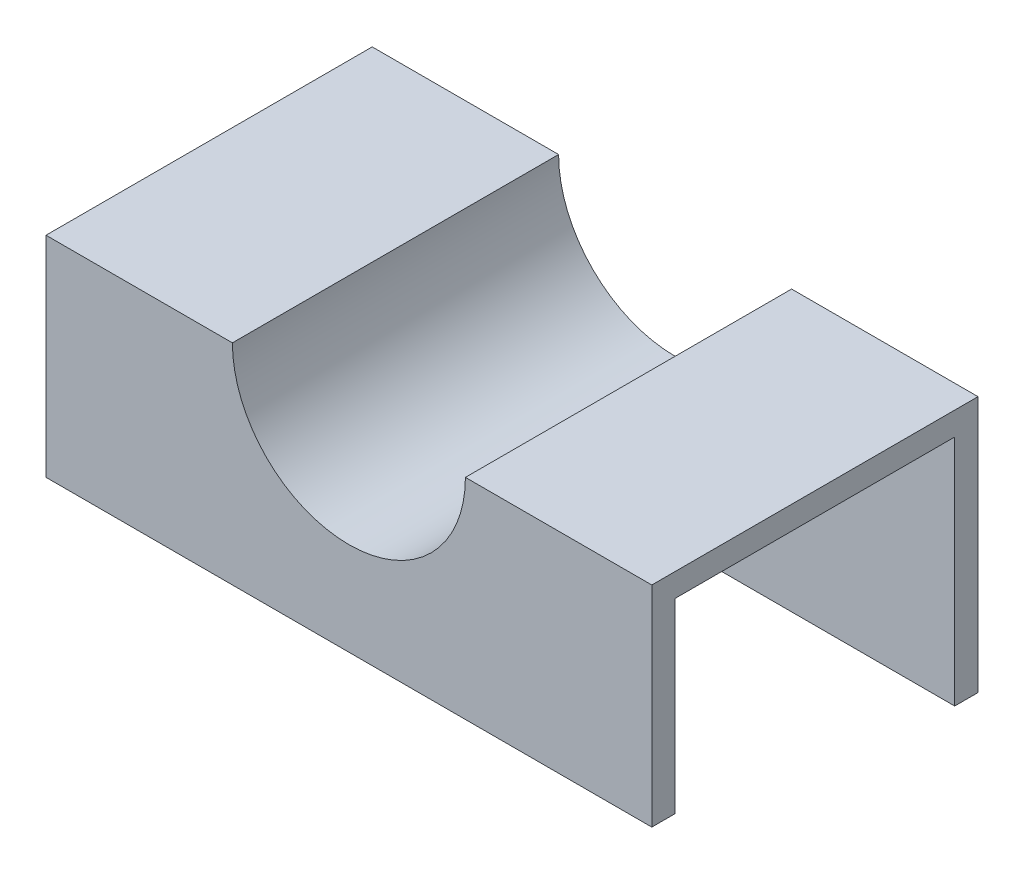
ISO-10303-21;
HEADER;
FILE_DESCRIPTION(('STEP AP214'),'2;1');
FILE_NAME('part.step','',(''),(''),'','','');
FILE_SCHEMA(('AUTOMOTIVE_DESIGN { 1 0 10303 214 1 1 1 1 }'));
ENDSEC;
DATA;
#1=APPLICATION_CONTEXT('core data for automotive mechanical design processes');
#2=APPLICATION_PROTOCOL_DEFINITION('international standard','automotive_design',2000,#1);
#3=PRODUCT_CONTEXT('',#1,'mechanical');
#4=PRODUCT('Part','Part','',(#3));
#5=PRODUCT_RELATED_PRODUCT_CATEGORY('part','',(#4));
#6=PRODUCT_DEFINITION_FORMATION('','',#4);
#7=PRODUCT_DEFINITION_CONTEXT('part definition',#1,'design');
#8=PRODUCT_DEFINITION('design','',#6,#7);
#9=PRODUCT_DEFINITION_SHAPE('','',#8);
#10=(LENGTH_UNIT() NAMED_UNIT(*) SI_UNIT(.MILLI.,.METRE.));
#11=(NAMED_UNIT(*) PLANE_ANGLE_UNIT() SI_UNIT($,.RADIAN.));
#12=(NAMED_UNIT(*) SI_UNIT($,.STERADIAN.) SOLID_ANGLE_UNIT());
#13=UNCERTAINTY_MEASURE_WITH_UNIT(LENGTH_MEASURE(1.E-05),#10,'distance_accuracy_value','');
#14=(GEOMETRIC_REPRESENTATION_CONTEXT(3) GLOBAL_UNCERTAINTY_ASSIGNED_CONTEXT((#13)) GLOBAL_UNIT_ASSIGNED_CONTEXT((#10,
#11,#12)) REPRESENTATION_CONTEXT('',''));
#15=CARTESIAN_POINT('',(0.,0.,0.));
#16=DIRECTION('',(0.,0.,1.));
#17=DIRECTION('',(1.,0.,0.));
#18=AXIS2_PLACEMENT_3D('',#15,#16,#17);
#19=CARTESIAN_POINT('',(-0.00534350019995957,0.207558409944158,0.00476642100056624));
#20=DIRECTION('',(1.62409768173737E-13,0.,-1.));
#21=DIRECTION('',(-1.,0.,-1.62409768173737E-13));
#22=AXIS2_PLACEMENT_3D('',#19,#20,#21);
#23=CYLINDRICAL_SURFACE('',#22,0.150000000000034);
#24=CARTESIAN_POINT('',(-0.00534350020001235,0.207558409944158,0.32976642100053));
#25=DIRECTION('',(-1.62409768173737E-13,0.,1.));
#26=DIRECTION('',(-1.,0.,-1.62409768173737E-13));
#27=AXIS2_PLACEMENT_3D('',#24,#25,#26);
#28=CIRCLE('',#27,0.150000000000034);
#29=CARTESIAN_POINT('',(-0.153245494777496,0.182558409944152,0.329766421000548));
#30=VERTEX_POINT('',#29);
#31=CARTESIAN_POINT('',(0.142558494377545,0.182558409944195,0.329766421000548));
#32=VERTEX_POINT('',#31);
#33=EDGE_CURVE('E11',#30,#32,#28,.T.);
#34=ORIENTED_EDGE('',*,*,#33,.F.);
#35=DIRECTION('',(0.,0.,1.));
#36=VECTOR('',#35,1.);
#37=CARTESIAN_POINT('',(-0.153245494777457,0.182558409944165,0.329766421000566));
#38=LINE('',#37,#36);
#39=CARTESIAN_POINT('',(-0.153245494777473,0.182558409944165,0.0297664210005843));
#40=VERTEX_POINT('',#39);
#41=EDGE_CURVE('E24',#40,#30,#38,.T.);
#42=ORIENTED_EDGE('',*,*,#41,.F.);
#43=CARTESIAN_POINT('',(-0.00534350019996363,0.207558409944158,0.0297664210006023));
#44=DIRECTION('',(1.62409768173737E-13,0.,-1.));
#45=DIRECTION('',(-1.,0.,-1.62409768173737E-13));
#46=AXIS2_PLACEMENT_3D('',#43,#44,#45);
#47=CIRCLE('',#46,0.150000000000034);
#48=CARTESIAN_POINT('',(0.142558494377571,0.1825584099442,0.0297664210005963));
#49=VERTEX_POINT('',#48);
#50=EDGE_CURVE('E203',#49,#40,#47,.T.);
#51=ORIENTED_EDGE('',*,*,#50,.F.);
#52=DIRECTION('',(0.,0.,-1.));
#53=VECTOR('',#52,1.);
#54=CARTESIAN_POINT('',(0.142558494377571,0.182558409944195,0.329766421000566));
#55=LINE('',#54,#53);
#56=EDGE_CURVE('E200',#32,#49,#55,.T.);
#57=ORIENTED_EDGE('',*,*,#56,.F.);
#58=EDGE_LOOP('',(#34,#42,#51,#57));
#59=FACE_BOUND('',#58,.T.);
#60=ADVANCED_FACE('F17',(#59),#23,.T.);
#61=CARTESIAN_POINT('',(0.319656499800088,0.182558409944213,0.329766421000566));
#62=DIRECTION('',(1.01196828694583E-13,-1.,0.));
#63=DIRECTION('',(1.,1.01196828694583E-13,0.));
#64=AXIS2_PLACEMENT_3D('',#61,#62,#63);
#65=PLANE('',#64);
#66=ORIENTED_EDGE('',*,*,#41,.T.);
#67=DIRECTION('',(1.,0.,0.));
#68=VECTOR('',#67,1.);
#69=CARTESIAN_POINT('',(0.319656499800114,0.182558409944147,0.329766421000566));
#70=LINE('',#69,#68);
#71=CARTESIAN_POINT('',(-0.330343500199882,0.182558409944147,0.329766421000566));
#72=VERTEX_POINT('',#71);
#73=EDGE_CURVE('E198',#72,#30,#70,.T.);
#74=ORIENTED_EDGE('',*,*,#73,.F.);
#75=DIRECTION('',(0.,0.,1.));
#76=VECTOR('',#75,1.);
#77=CARTESIAN_POINT('',(-0.330343500199889,0.182558409944147,0.329766421000566));
#78=LINE('',#77,#76);
#79=CARTESIAN_POINT('',(-0.330343500199889,0.182558409944154,0.0297664210005663));
#80=VERTEX_POINT('',#79);
#81=EDGE_CURVE('E195',#80,#72,#78,.T.);
#82=ORIENTED_EDGE('',*,*,#81,.F.);
#83=DIRECTION('',(-1.,0.,0.));
#84=VECTOR('',#83,1.);
#85=CARTESIAN_POINT('',(-0.00534350019988747,0.182558409944165,0.0297664210005663));
#86=LINE('',#85,#84);
#87=EDGE_CURVE('E192',#40,#80,#86,.T.);
#88=ORIENTED_EDGE('',*,*,#87,.F.);
#89=EDGE_LOOP('',(#66,#74,#82,#88));
#90=FACE_BOUND('',#89,.T.);
#91=ADVANCED_FACE('F207',(#90),#65,.T.);
#92=CARTESIAN_POINT('',(-0.0053435001999368,-0.0174415900558082,0.342266421000566));
#93=DIRECTION('',(1.0119682869504E-13,-1.,0.));
#94=DIRECTION('',(1.,1.0119682869504E-13,0.));
#95=AXIS2_PLACEMENT_3D('',#92,#93,#94);
#96=PLANE('',#95);
#97=DIRECTION('',(-1.,0.,0.));
#98=VECTOR('',#97,1.);
#99=CARTESIAN_POINT('',(0.319656499800114,-0.0174415900557754,0.329766421000566));
#100=LINE('',#99,#98);
#101=CARTESIAN_POINT('',(0.319656499800109,-0.0174415900557754,0.329766421000566));
#102=VERTEX_POINT('',#101);
#103=CARTESIAN_POINT('',(-0.330343500199869,-0.0174415900558192,0.329766421000566));
#104=VERTEX_POINT('',#103);
#105=EDGE_CURVE('E190',#102,#104,#100,.T.);
#106=ORIENTED_EDGE('',*,*,#105,.F.);
#107=DIRECTION('',(0.,0.,-1.));
#108=VECTOR('',#107,1.);
#109=CARTESIAN_POINT('',(0.319656499800109,-0.0174415900557754,0.354766421000566));
#110=LINE('',#109,#108);
#111=CARTESIAN_POINT('',(0.319656499800109,-0.0174415900557973,0.354766421000566));
#112=VERTEX_POINT('',#111);
#113=EDGE_CURVE('E187',#112,#102,#110,.T.);
#114=ORIENTED_EDGE('',*,*,#113,.F.);
#115=DIRECTION('',(1.,0.,0.));
#116=VECTOR('',#115,1.);
#117=CARTESIAN_POINT('',(-0.330343500199864,-0.0174415900558411,0.354766421000566));
#118=LINE('',#117,#116);
#119=CARTESIAN_POINT('',(-0.330343500199876,-0.0174415900558411,0.354766421000566));
#120=VERTEX_POINT('',#119);
#121=EDGE_CURVE('E184',#120,#112,#118,.T.);
#122=ORIENTED_EDGE('',*,*,#121,.F.);
#123=DIRECTION('',(0.,0.,1.));
#124=VECTOR('',#123,1.);
#125=CARTESIAN_POINT('',(-0.330343500199869,-0.0174415900558411,0.329766421000566));
#126=LINE('',#125,#124);
#127=EDGE_CURVE('E181',#104,#120,#126,.T.);
#128=ORIENTED_EDGE('',*,*,#127,.F.);
#129=EDGE_LOOP('',(#106,#114,#122,#128));
#130=FACE_BOUND('',#129,.T.);
#131=ADVANCED_FACE('F226',(#130),#96,.T.);
#132=CARTESIAN_POINT('',(0.319656499800114,-0.0674415900557867,0.329766421000566));
#133=DIRECTION('',(0.,0.,-1.));
#134=DIRECTION('',(-1.,0.,0.));
#135=AXIS2_PLACEMENT_3D('',#132,#133,#134);
#136=PLANE('',#135);
#137=ORIENTED_EDGE('',*,*,#73,.T.);
#138=ORIENTED_EDGE('',*,*,#33,.T.);
#139=DIRECTION('',(-1.,-1.01196828694583E-13,0.));
#140=VECTOR('',#139,1.);
#141=CARTESIAN_POINT('',(0.319656499800088,0.182558409944213,0.329766421000566));
#142=LINE('',#141,#140);
#143=CARTESIAN_POINT('',(0.319656499800088,0.182558409944213,0.329766421000566));
#144=VERTEX_POINT('',#143);
#145=EDGE_CURVE('E178',#144,#32,#142,.T.);
#146=ORIENTED_EDGE('',*,*,#145,.F.);
#147=DIRECTION('',(-1.01196828694583E-13,1.,0.));
#148=VECTOR('',#147,1.);
#149=CARTESIAN_POINT('',(0.319656499800114,-0.0674415900557867,0.329766421000566));
#150=LINE('',#149,#148);
#151=EDGE_CURVE('E175',#102,#144,#150,.T.);
#152=ORIENTED_EDGE('',*,*,#151,.F.);
#153=ORIENTED_EDGE('',*,*,#105,.T.);
#154=DIRECTION('',(1.01196828694583E-13,-1.,0.));
#155=VECTOR('',#154,1.);
#156=CARTESIAN_POINT('',(-0.330343500199864,-0.0674415900558524,0.329766421000566));
#157=LINE('',#156,#155);
#158=EDGE_CURVE('E172',#72,#104,#157,.T.);
#159=ORIENTED_EDGE('',*,*,#158,.F.);
#160=EDGE_LOOP('',(#137,#138,#146,#152,#153,#159));
#161=FACE_BOUND('',#160,.T.);
#162=ADVANCED_FACE('F209',(#161),#136,.T.);
#163=CARTESIAN_POINT('',(0.319656499800088,0.182558409944213,0.329766421000566));
#164=DIRECTION('',(1.01196828694583E-13,-1.,0.));
#165=DIRECTION('',(1.,1.01196828694583E-13,0.));
#166=AXIS2_PLACEMENT_3D('',#163,#164,#165);
#167=PLANE('',#166);
#168=ORIENTED_EDGE('',*,*,#56,.T.);
#169=DIRECTION('',(-1.,0.,0.));
#170=VECTOR('',#169,1.);
#171=CARTESIAN_POINT('',(-0.00534350019988747,0.182558409944213,0.0297664210005663));
#172=LINE('',#171,#170);
#173=CARTESIAN_POINT('',(0.319656499800097,0.182558409944213,0.0297664210005663));
#174=VERTEX_POINT('',#173);
#175=EDGE_CURVE('E169',#174,#49,#172,.T.);
#176=ORIENTED_EDGE('',*,*,#175,.F.);
#177=DIRECTION('',(0.,0.,-1.));
#178=VECTOR('',#177,1.);
#179=CARTESIAN_POINT('',(0.319656499800088,0.182558409944213,0.354766421000566));
#180=LINE('',#179,#178);
#181=EDGE_CURVE('E166',#144,#174,#180,.T.);
#182=ORIENTED_EDGE('',*,*,#181,.F.);
#183=ORIENTED_EDGE('',*,*,#145,.T.);
#184=EDGE_LOOP('',(#168,#176,#182,#183));
#185=FACE_BOUND('',#184,.T.);
#186=ADVANCED_FACE('F220',(#185),#167,.T.);
#187=CARTESIAN_POINT('',(-0.00534350019988747,0.0575584099442089,0.0297664210005663));
#188=DIRECTION('',(0.,0.,1.));
#189=DIRECTION('',(1.,0.,0.));
#190=AXIS2_PLACEMENT_3D('',#187,#188,#189);
#191=PLANE('',#190);
#192=DIRECTION('',(-1.01196828694583E-13,1.,0.));
#193=VECTOR('',#192,1.);
#194=CARTESIAN_POINT('',(-0.330343500199864,-0.0674415900558524,0.0297664210005664));
#195=LINE('',#194,#193);
#196=CARTESIAN_POINT('',(-0.330343500199838,-0.067441590055824,0.0297664210005664));
#197=VERTEX_POINT('',#196);
#198=EDGE_CURVE('E163',#197,#80,#195,.T.);
#199=ORIENTED_EDGE('',*,*,#198,.F.);
#200=DIRECTION('',(-1.,0.,0.));
#201=VECTOR('',#200,1.);
#202=CARTESIAN_POINT('',(-0.330343500199807,-0.067441590055824,0.0297664210005664));
#203=LINE('',#202,#201);
#204=CARTESIAN_POINT('',(0.319656499800114,-0.0674415900557866,0.0297664210005664));
#205=VERTEX_POINT('',#204);
#206=EDGE_CURVE('E160',#205,#197,#203,.T.);
#207=ORIENTED_EDGE('',*,*,#206,.F.);
#208=DIRECTION('',(1.01196828694583E-13,-1.,0.));
#209=VECTOR('',#208,1.);
#210=CARTESIAN_POINT('',(0.319656499800114,-0.0674415900557867,0.0297664210005664));
#211=LINE('',#210,#209);
#212=EDGE_CURVE('E157',#174,#205,#211,.T.);
#213=ORIENTED_EDGE('',*,*,#212,.F.);
#214=ORIENTED_EDGE('',*,*,#175,.T.);
#215=ORIENTED_EDGE('',*,*,#50,.T.);
#216=ORIENTED_EDGE('',*,*,#87,.T.);
#217=EDGE_LOOP('',(#199,#207,#213,#214,#215,#216));
#218=FACE_BOUND('',#217,.T.);
#219=ADVANCED_FACE('F217',(#218),#191,.T.);
#220=CARTESIAN_POINT('',(-0.330343500199864,-0.0674415900558524,0.354766421000566));
#221=DIRECTION('',(0.,0.,1.));
#222=DIRECTION('',(1.,0.,0.));
#223=AXIS2_PLACEMENT_3D('',#220,#221,#222);
#224=PLANE('',#223);
#225=DIRECTION('',(1.,1.01196828694583E-13,0.));
#226=VECTOR('',#225,1.);
#227=CARTESIAN_POINT('',(0.144656499800075,0.207558409944201,0.354766421000587));
#228=LINE('',#227,#226);
#229=CARTESIAN_POINT('',(0.11965649980004,0.207558409944199,0.354766421000577));
#230=VERTEX_POINT('',#229);
#231=CARTESIAN_POINT('',(0.319656499800086,0.207558409944219,0.35476642100058));
#232=VERTEX_POINT('',#231);
#233=EDGE_CURVE('E155',#230,#232,#228,.T.);
#234=ORIENTED_EDGE('',*,*,#233,.F.);
#235=CARTESIAN_POINT('',(-0.00534350019995957,0.207558409944215,0.354766421000566));
#236=DIRECTION('',(1.62409768173737E-13,0.,-1.));
#237=DIRECTION('',(-1.,0.,-1.62409768173737E-13));
#238=AXIS2_PLACEMENT_3D('',#235,#236,#237);
#239=CIRCLE('',#238,0.125);
#240=CARTESIAN_POINT('',(-0.13034350019996,0.207558409944194,0.354766421000556));
#241=VERTEX_POINT('',#240);
#242=EDGE_CURVE('E118',#230,#241,#239,.T.);
#243=ORIENTED_EDGE('',*,*,#242,.T.);
#244=DIRECTION('',(1.,1.01196828694583E-13,0.));
#245=VECTOR('',#244,1.);
#246=CARTESIAN_POINT('',(-0.130343500199903,0.207558409944173,0.354766421000566));
#247=LINE('',#246,#245);
#248=CARTESIAN_POINT('',(-0.330343500199891,0.207558409944153,0.354766421000566));
#249=VERTEX_POINT('',#248);
#250=EDGE_CURVE('E151',#249,#241,#247,.T.);
#251=ORIENTED_EDGE('',*,*,#250,.F.);
#252=DIRECTION('',(-1.01196828694583E-13,1.,0.));
#253=VECTOR('',#252,1.);
#254=CARTESIAN_POINT('',(-0.330343500199864,-0.0674415900558524,0.354766421000566));
#255=LINE('',#254,#253);
#256=EDGE_CURVE('E148',#120,#249,#255,.T.);
#257=ORIENTED_EDGE('',*,*,#256,.F.);
#258=ORIENTED_EDGE('',*,*,#121,.T.);
#259=DIRECTION('',(1.01196828694583E-13,-1.,0.));
#260=VECTOR('',#259,1.);
#261=CARTESIAN_POINT('',(0.319656499800114,-0.0674415900557867,0.354766421000566));
#262=LINE('',#261,#260);
#263=EDGE_CURVE('E145',#232,#112,#262,.T.);
#264=ORIENTED_EDGE('',*,*,#263,.F.);
#265=EDGE_LOOP('',(#234,#243,#251,#257,#258,#264));
#266=FACE_BOUND('',#265,.T.);
#267=ADVANCED_FACE('F228',(#266),#224,.T.);
#268=CARTESIAN_POINT('',(-0.130343500199903,0.207558409944173,0.00476642100056624));
#269=DIRECTION('',(-1.01196828694583E-13,1.,0.));
#270=DIRECTION('',(-1.,-1.01196828694583E-13,0.));
#271=AXIS2_PLACEMENT_3D('',#268,#269,#270);
#272=PLANE('',#271);
#273=ORIENTED_EDGE('',*,*,#250,.T.);
#274=DIRECTION('',(1.62409768173737E-13,0.,-1.));
#275=VECTOR('',#274,1.);
#276=CARTESIAN_POINT('',(-0.13034350019996,0.207558409944215,0.354766421000566));
#277=LINE('',#276,#275);
#278=CARTESIAN_POINT('',(-0.130343500199903,0.207558409944194,0.00476642100056624));
#279=VERTEX_POINT('',#278);
#280=EDGE_CURVE('E143',#241,#279,#277,.T.);
#281=ORIENTED_EDGE('',*,*,#280,.T.);
#282=DIRECTION('',(-1.,0.,0.));
#283=VECTOR('',#282,1.);
#284=CARTESIAN_POINT('',(-0.00534350019989506,0.207558409944173,0.00476642100056624));
#285=LINE('',#284,#283);
#286=CARTESIAN_POINT('',(-0.330343500199891,0.207558409944167,0.00476642100056624));
#287=VERTEX_POINT('',#286);
#288=EDGE_CURVE('E123',#279,#287,#285,.T.);
#289=ORIENTED_EDGE('',*,*,#288,.T.);
#290=DIRECTION('',(0.,0.,-1.));
#291=VECTOR('',#290,1.);
#292=CARTESIAN_POINT('',(-0.330343500199891,0.207558409944153,0.329766421000566));
#293=LINE('',#292,#291);
#294=EDGE_CURVE('E139',#249,#287,#293,.T.);
#295=ORIENTED_EDGE('',*,*,#294,.F.);
#296=EDGE_LOOP('',(#273,#281,#289,#295));
#297=FACE_BOUND('',#296,.T.);
#298=ADVANCED_FACE('F231',(#297),#272,.T.);
#299=CARTESIAN_POINT('',(-0.330343500199864,-0.0674415900558524,0.329766421000566));
#300=DIRECTION('',(-1.,-1.01196828694583E-13,0.));
#301=DIRECTION('',(1.01196828694583E-13,-1.,0.));
#302=AXIS2_PLACEMENT_3D('',#299,#300,#301);
#303=PLANE('',#302);
#304=DIRECTION('',(0.,0.,-1.));
#305=VECTOR('',#304,1.);
#306=CARTESIAN_POINT('',(-0.330343500199826,-0.067441590055824,0.00476642100056629));
#307=LINE('',#306,#305);
#308=CARTESIAN_POINT('',(-0.330343500199869,-0.067441590055824,0.00476642100056624));
#309=VERTEX_POINT('',#308);
#310=EDGE_CURVE('E137',#197,#309,#307,.T.);
#311=ORIENTED_EDGE('',*,*,#310,.F.);
#312=ORIENTED_EDGE('',*,*,#198,.T.);
#313=ORIENTED_EDGE('',*,*,#81,.T.);
#314=ORIENTED_EDGE('',*,*,#158,.T.);
#315=ORIENTED_EDGE('',*,*,#127,.T.);
#316=ORIENTED_EDGE('',*,*,#256,.T.);
#317=ORIENTED_EDGE('',*,*,#294,.T.);
#318=DIRECTION('',(0.,-1.,0.));
#319=VECTOR('',#318,1.);
#320=CARTESIAN_POINT('',(-0.330343500199891,0.132337635525106,0.00476642100056624));
#321=LINE('',#320,#319);
#322=EDGE_CURVE('E134',#287,#309,#321,.T.);
#323=ORIENTED_EDGE('',*,*,#322,.T.);
#324=EDGE_LOOP('',(#311,#312,#313,#314,#315,#316,#317,#323));
#325=FACE_BOUND('',#324,.T.);
#326=ADVANCED_FACE('F214',(#325),#303,.T.);
#327=CARTESIAN_POINT('',(-0.330343500199807,-0.067441590055824,0.00476642100056629));
#328=DIRECTION('',(0.,-1.,0.));
#329=DIRECTION('',(1.,0.,0.));
#330=AXIS2_PLACEMENT_3D('',#327,#328,#329);
#331=PLANE('',#330);
#332=ORIENTED_EDGE('',*,*,#206,.T.);
#333=ORIENTED_EDGE('',*,*,#310,.T.);
#334=DIRECTION('',(1.,0.,0.));
#335=VECTOR('',#334,1.);
#336=CARTESIAN_POINT('',(-0.00534350019989506,-0.067441590055824,0.00476642100056624));
#337=LINE('',#336,#335);
#338=CARTESIAN_POINT('',(0.319656499800114,-0.0674415900558115,0.00476642100056624));
#339=VERTEX_POINT('',#338);
#340=EDGE_CURVE('E132',#309,#339,#337,.T.);
#341=ORIENTED_EDGE('',*,*,#340,.T.);
#342=DIRECTION('',(0.,0.,-1.));
#343=VECTOR('',#342,1.);
#344=CARTESIAN_POINT('',(0.319656499800114,-0.0674415900557867,0.354766421000566));
#345=LINE('',#344,#343);
#346=EDGE_CURVE('E129',#205,#339,#345,.T.);
#347=ORIENTED_EDGE('',*,*,#346,.F.);
#348=EDGE_LOOP('',(#332,#333,#341,#347));
#349=FACE_BOUND('',#348,.T.);
#350=ADVANCED_FACE('F239',(#349),#331,.T.);
#351=CARTESIAN_POINT('',(0.319656499800114,-0.0674415900557867,0.354766421000566));
#352=DIRECTION('',(1.,1.01196828694583E-13,0.));
#353=DIRECTION('',(-1.01196828694583E-13,1.,0.));
#354=AXIS2_PLACEMENT_3D('',#351,#352,#353);
#355=PLANE('',#354);
#356=ORIENTED_EDGE('',*,*,#346,.T.);
#357=DIRECTION('',(0.,1.,0.));
#358=VECTOR('',#357,1.);
#359=CARTESIAN_POINT('',(0.319656499800114,0.132337635525106,0.00476642100056624));
#360=LINE('',#359,#358);
#361=CARTESIAN_POINT('',(0.319656499800104,0.207558409944219,0.00476642100056624));
#362=VERTEX_POINT('',#361);
#363=EDGE_CURVE('E127',#339,#362,#360,.T.);
#364=ORIENTED_EDGE('',*,*,#363,.T.);
#365=DIRECTION('',(0.,0.,-1.));
#366=VECTOR('',#365,1.);
#367=CARTESIAN_POINT('',(0.319656499800086,0.207558409944219,0.00476642100056624));
#368=LINE('',#367,#366);
#369=EDGE_CURVE('E107',#232,#362,#368,.T.);
#370=ORIENTED_EDGE('',*,*,#369,.F.);
#371=ORIENTED_EDGE('',*,*,#263,.T.);
#372=ORIENTED_EDGE('',*,*,#113,.T.);
#373=ORIENTED_EDGE('',*,*,#151,.T.);
#374=ORIENTED_EDGE('',*,*,#181,.T.);
#375=ORIENTED_EDGE('',*,*,#212,.T.);
#376=EDGE_LOOP('',(#356,#364,#370,#371,#372,#373,#374,#375));
#377=FACE_BOUND('',#376,.T.);
#378=ADVANCED_FACE('F223',(#377),#355,.T.);
#379=CARTESIAN_POINT('',(0.144656499800075,0.207558409944201,0.00476642100056624));
#380=DIRECTION('',(-1.01196828694583E-13,1.,0.));
#381=DIRECTION('',(-1.,-1.01196828694583E-13,0.));
#382=AXIS2_PLACEMENT_3D('',#379,#380,#381);
#383=PLANE('',#382);
#384=ORIENTED_EDGE('',*,*,#233,.T.);
#385=ORIENTED_EDGE('',*,*,#369,.T.);
#386=DIRECTION('',(-1.,0.,0.));
#387=VECTOR('',#386,1.);
#388=CARTESIAN_POINT('',(-0.00534350019989506,0.207558409944219,0.00476642100056624));
#389=LINE('',#388,#387);
#390=CARTESIAN_POINT('',(0.119656499800097,0.207558409944204,0.00476642100058144));
#391=VERTEX_POINT('',#390);
#392=EDGE_CURVE('E102',#362,#391,#389,.T.);
#393=ORIENTED_EDGE('',*,*,#392,.T.);
#394=DIRECTION('',(-1.62409768173737E-13,0.,1.));
#395=VECTOR('',#394,1.);
#396=CARTESIAN_POINT('',(0.11965649980004,0.207558409944199,0.354766421000607));
#397=LINE('',#396,#395);
#398=EDGE_CURVE('E105',#391,#230,#397,.T.);
#399=ORIENTED_EDGE('',*,*,#398,.T.);
#400=EDGE_LOOP('',(#384,#385,#393,#399));
#401=FACE_BOUND('',#400,.T.);
#402=ADVANCED_FACE('F104',(#401),#383,.T.);
#403=CARTESIAN_POINT('',(-0.00534350019995957,0.207558409944215,0.354766421000587));
#404=DIRECTION('',(1.62409768173737E-13,0.,-1.));
#405=DIRECTION('',(-1.,0.,-1.62409768173737E-13));
#406=AXIS2_PLACEMENT_3D('',#403,#404,#405);
#407=CYLINDRICAL_SURFACE('',#406,0.125);
#408=ORIENTED_EDGE('',*,*,#280,.F.);
#409=ORIENTED_EDGE('',*,*,#242,.F.);
#410=ORIENTED_EDGE('',*,*,#398,.F.);
#411=CARTESIAN_POINT('',(-0.00534350019990273,0.207558409944215,0.00476642100057638));
#412=DIRECTION('',(1.62409768173737E-13,0.,-1.));
#413=DIRECTION('',(-1.,0.,-1.62409768173737E-13));
#414=AXIS2_PLACEMENT_3D('',#411,#412,#413);
#415=CIRCLE('',#414,0.125);
#416=EDGE_CURVE('E117',#391,#279,#415,.T.);
#417=ORIENTED_EDGE('',*,*,#416,.T.);
#418=EDGE_LOOP('',(#408,#409,#410,#417));
#419=FACE_BOUND('',#418,.T.);
#420=ADVANCED_FACE('F116',(#419),#407,.F.);
#421=CARTESIAN_POINT('',(-0.00534350019989506,0.132337635525106,0.00476642100056624));
#422=DIRECTION('',(0.,0.,1.));
#423=DIRECTION('',(1.,0.,0.));
#424=AXIS2_PLACEMENT_3D('',#421,#422,#423);
#425=PLANE('',#424);
#426=ORIENTED_EDGE('',*,*,#392,.F.);
#427=ORIENTED_EDGE('',*,*,#363,.F.);
#428=ORIENTED_EDGE('',*,*,#340,.F.);
#429=ORIENTED_EDGE('',*,*,#322,.F.);
#430=ORIENTED_EDGE('',*,*,#288,.F.);
#431=ORIENTED_EDGE('',*,*,#416,.F.);
#432=EDGE_LOOP('',(#426,#427,#428,#429,#430,#431));
#433=FACE_BOUND('',#432,.T.);
#434=ADVANCED_FACE('F121',(#433),#425,.F.);
#435=CLOSED_SHELL('',(#60,#91,#131,#162,#186,#219,#267,#298,#326,#350,#378,#402,#420,#434));
#436=MANIFOLD_SOLID_BREP('B1',#435);
#437=ADVANCED_BREP_SHAPE_REPRESENTATION('',(#18,#436),#14);
#438=SHAPE_DEFINITION_REPRESENTATION(#9,#437);
ENDSEC;
END-ISO-10303-21;
